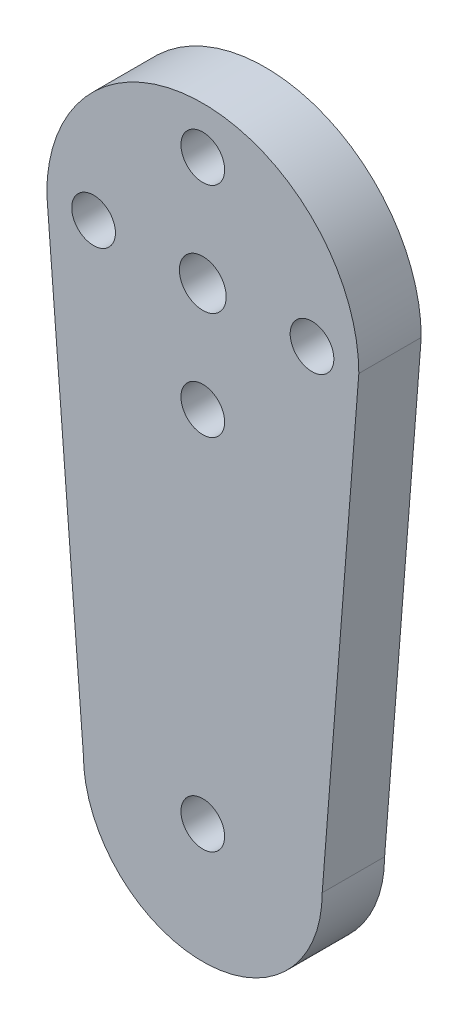
ISO-10303-21;
HEADER;
FILE_DESCRIPTION(('STEP AP214'),'2;1');
FILE_NAME('part.step','',(''),(''),'','','');
FILE_SCHEMA(('AUTOMOTIVE_DESIGN { 1 0 10303 214 1 1 1 1 }'));
ENDSEC;
DATA;
#1=APPLICATION_CONTEXT('core data for automotive mechanical design processes');
#2=APPLICATION_PROTOCOL_DEFINITION('international standard','automotive_design',2000,#1);
#3=PRODUCT_CONTEXT('',#1,'mechanical');
#4=PRODUCT('Part','Part','',(#3));
#5=PRODUCT_RELATED_PRODUCT_CATEGORY('part','',(#4));
#6=PRODUCT_DEFINITION_FORMATION('','',#4);
#7=PRODUCT_DEFINITION_CONTEXT('part definition',#1,'design');
#8=PRODUCT_DEFINITION('design','',#6,#7);
#9=PRODUCT_DEFINITION_SHAPE('','',#8);
#10=(LENGTH_UNIT() NAMED_UNIT(*) SI_UNIT(.MILLI.,.METRE.));
#11=(NAMED_UNIT(*) PLANE_ANGLE_UNIT() SI_UNIT($,.RADIAN.));
#12=(NAMED_UNIT(*) SI_UNIT($,.STERADIAN.) SOLID_ANGLE_UNIT());
#13=UNCERTAINTY_MEASURE_WITH_UNIT(LENGTH_MEASURE(1.E-05),#10,'distance_accuracy_value','');
#14=(GEOMETRIC_REPRESENTATION_CONTEXT(3) GLOBAL_UNCERTAINTY_ASSIGNED_CONTEXT((#13)) GLOBAL_UNIT_ASSIGNED_CONTEXT((#10,
#11,#12)) REPRESENTATION_CONTEXT('',''));
#15=CARTESIAN_POINT('',(0.,0.,0.));
#16=DIRECTION('',(0.,0.,1.));
#17=DIRECTION('',(1.,0.,0.));
#18=AXIS2_PLACEMENT_3D('',#15,#16,#17);
#19=CARTESIAN_POINT('',(0.,-30.,4.));
#20=DIRECTION('',(0.,0.,1.));
#21=DIRECTION('',(1.,0.,0.));
#22=AXIS2_PLACEMENT_3D('',#19,#20,#21);
#23=PLANE('',#22);
#24=CARTESIAN_POINT('',(0.,-7.,4.));
#25=DIRECTION('',(0.,0.,1.));
#26=DIRECTION('',(1.,0.,0.));
#27=AXIS2_PLACEMENT_3D('',#24,#25,#26);
#28=CIRCLE('',#27,1.4);
#29=CARTESIAN_POINT('',(1.4,-7.,4.));
#30=VERTEX_POINT('',#29);
#31=EDGE_CURVE('E234',#30,#30,#28,.T.);
#32=ORIENTED_EDGE('',*,*,#31,.F.);
#33=EDGE_LOOP('',(#32));
#34=FACE_BOUND('',#33,.T.);
#35=CARTESIAN_POINT('',(0.,0.,4.));
#36=DIRECTION('',(0.,0.,1.));
#37=DIRECTION('',(1.,0.,0.));
#38=AXIS2_PLACEMENT_3D('',#35,#36,#37);
#39=CIRCLE('',#38,1.5);
#40=CARTESIAN_POINT('',(1.5,0.,4.));
#41=VERTEX_POINT('',#40);
#42=EDGE_CURVE('E242',#41,#41,#39,.T.);
#43=ORIENTED_EDGE('',*,*,#42,.F.);
#44=EDGE_LOOP('',(#43));
#45=FACE_BOUND('',#44,.T.);
#46=CARTESIAN_POINT('',(-7.,0.,4.));
#47=DIRECTION('',(0.,0.,1.));
#48=DIRECTION('',(1.,0.,0.));
#49=AXIS2_PLACEMENT_3D('',#46,#47,#48);
#50=CIRCLE('',#49,1.4);
#51=CARTESIAN_POINT('',(-5.6,0.,4.));
#52=VERTEX_POINT('',#51);
#53=EDGE_CURVE('E192',#52,#52,#50,.T.);
#54=ORIENTED_EDGE('',*,*,#53,.F.);
#55=EDGE_LOOP('',(#54));
#56=FACE_BOUND('',#55,.T.);
#57=DIRECTION('',(0.0779982555262888,-0.99695349547251,0.));
#58=VECTOR('',#57,1.);
#59=CARTESIAN_POINT('',(-10.,0.,4.));
#60=LINE('',#59,#58);
#61=CARTESIAN_POINT('',(-10.,0.,4.));
#62=VERTEX_POINT('',#61);
#63=CARTESIAN_POINT('',(-7.65290188919029,-30.,4.));
#64=VERTEX_POINT('',#63);
#65=EDGE_CURVE('E174',#62,#64,#60,.T.);
#66=ORIENTED_EDGE('',*,*,#65,.T.);
#67=CARTESIAN_POINT('',(0.,-30.,4.));
#68=DIRECTION('',(0.,0.,1.));
#69=DIRECTION('',(1.,0.,0.));
#70=AXIS2_PLACEMENT_3D('',#67,#68,#69);
#71=CIRCLE('',#70,7.65290188919029);
#72=CARTESIAN_POINT('',(7.65290188919029,-30.,4.));
#73=VERTEX_POINT('',#72);
#74=EDGE_CURVE('E169',#64,#73,#71,.T.);
#75=ORIENTED_EDGE('',*,*,#74,.T.);
#76=DIRECTION('',(-0.0779982555262888,-0.99695349547251,0.));
#77=VECTOR('',#76,1.);
#78=CARTESIAN_POINT('',(10.,0.,4.));
#79=LINE('',#78,#77);
#80=CARTESIAN_POINT('',(10.,0.,4.));
#81=VERTEX_POINT('',#80);
#82=EDGE_CURVE('E172',#81,#73,#79,.T.);
#83=ORIENTED_EDGE('',*,*,#82,.F.);
#84=CARTESIAN_POINT('',(0.,0.,4.));
#85=DIRECTION('',(0.,0.,1.));
#86=DIRECTION('',(1.,0.,0.));
#87=AXIS2_PLACEMENT_3D('',#84,#85,#86);
#88=CIRCLE('',#87,10.);
#89=EDGE_CURVE('E143',#81,#62,#88,.T.);
#90=ORIENTED_EDGE('',*,*,#89,.T.);
#91=EDGE_LOOP('',(#66,#75,#83,#90));
#92=FACE_BOUND('',#91,.T.);
#93=CARTESIAN_POINT('',(0.,7.,4.));
#94=DIRECTION('',(0.,0.,1.));
#95=DIRECTION('',(1.,0.,0.));
#96=AXIS2_PLACEMENT_3D('',#93,#94,#95);
#97=CIRCLE('',#96,1.4);
#98=CARTESIAN_POINT('',(1.4,7.,4.));
#99=VERTEX_POINT('',#98);
#100=EDGE_CURVE('E246',#99,#99,#97,.T.);
#101=ORIENTED_EDGE('',*,*,#100,.F.);
#102=EDGE_LOOP('',(#101));
#103=FACE_BOUND('',#102,.T.);
#104=CARTESIAN_POINT('',(7.,0.,4.));
#105=DIRECTION('',(0.,0.,1.));
#106=DIRECTION('',(1.,0.,0.));
#107=AXIS2_PLACEMENT_3D('',#104,#105,#106);
#108=CIRCLE('',#107,1.4);
#109=CARTESIAN_POINT('',(8.4,0.,4.));
#110=VERTEX_POINT('',#109);
#111=EDGE_CURVE('E238',#110,#110,#108,.T.);
#112=ORIENTED_EDGE('',*,*,#111,.F.);
#113=EDGE_LOOP('',(#112));
#114=FACE_BOUND('',#113,.T.);
#115=CARTESIAN_POINT('',(0.,-30.,4.));
#116=DIRECTION('',(0.,0.,1.));
#117=DIRECTION('',(1.,0.,0.));
#118=AXIS2_PLACEMENT_3D('',#115,#116,#117);
#119=CIRCLE('',#118,1.4);
#120=CARTESIAN_POINT('',(1.4,-30.,4.));
#121=VERTEX_POINT('',#120);
#122=EDGE_CURVE('E229',#121,#121,#119,.T.);
#123=ORIENTED_EDGE('',*,*,#122,.F.);
#124=EDGE_LOOP('',(#123));
#125=FACE_BOUND('',#124,.T.);
#126=ADVANCED_FACE('F126',(#34,#45,#56,#92,#103,#114,#125),#23,.T.);
#127=CARTESIAN_POINT('',(0.,-30.,0.));
#128=DIRECTION('',(0.,0.,1.));
#129=DIRECTION('',(1.,0.,0.));
#130=AXIS2_PLACEMENT_3D('',#127,#128,#129);
#131=PLANE('',#130);
#132=DIRECTION('',(0.0779982555262888,-0.99695349547251,0.));
#133=VECTOR('',#132,1.);
#134=CARTESIAN_POINT('',(-10.,0.,0.));
#135=LINE('',#134,#133);
#136=CARTESIAN_POINT('',(-10.,0.,0.));
#137=VERTEX_POINT('',#136);
#138=CARTESIAN_POINT('',(-7.65290188919029,-30.,0.));
#139=VERTEX_POINT('',#138);
#140=EDGE_CURVE('E189',#137,#139,#135,.T.);
#141=ORIENTED_EDGE('',*,*,#140,.F.);
#142=CARTESIAN_POINT('',(0.,0.,0.));
#143=DIRECTION('',(0.,0.,1.));
#144=DIRECTION('',(1.,0.,0.));
#145=AXIS2_PLACEMENT_3D('',#142,#143,#144);
#146=CIRCLE('',#145,10.);
#147=CARTESIAN_POINT('',(10.,0.,0.));
#148=VERTEX_POINT('',#147);
#149=EDGE_CURVE('E162',#148,#137,#146,.T.);
#150=ORIENTED_EDGE('',*,*,#149,.F.);
#151=DIRECTION('',(-0.0779982555262888,-0.99695349547251,0.));
#152=VECTOR('',#151,1.);
#153=CARTESIAN_POINT('',(10.,0.,0.));
#154=LINE('',#153,#152);
#155=CARTESIAN_POINT('',(7.65290188919029,-30.,0.));
#156=VERTEX_POINT('',#155);
#157=EDGE_CURVE('E194',#148,#156,#154,.T.);
#158=ORIENTED_EDGE('',*,*,#157,.T.);
#159=CARTESIAN_POINT('',(0.,-30.,0.));
#160=DIRECTION('',(0.,0.,1.));
#161=DIRECTION('',(1.,0.,0.));
#162=AXIS2_PLACEMENT_3D('',#159,#160,#161);
#163=CIRCLE('',#162,7.65290188919029);
#164=EDGE_CURVE('E179',#139,#156,#163,.T.);
#165=ORIENTED_EDGE('',*,*,#164,.F.);
#166=EDGE_LOOP('',(#141,#150,#158,#165));
#167=FACE_BOUND('',#166,.T.);
#168=CARTESIAN_POINT('',(-7.,0.,0.));
#169=DIRECTION('',(0.,0.,1.));
#170=DIRECTION('',(1.,0.,0.));
#171=AXIS2_PLACEMENT_3D('',#168,#169,#170);
#172=CIRCLE('',#171,1.4);
#173=CARTESIAN_POINT('',(-5.6,0.,0.));
#174=VERTEX_POINT('',#173);
#175=EDGE_CURVE('E208',#174,#174,#172,.T.);
#176=ORIENTED_EDGE('',*,*,#175,.T.);
#177=EDGE_LOOP('',(#176));
#178=FACE_BOUND('',#177,.T.);
#179=CARTESIAN_POINT('',(0.,7.,0.));
#180=DIRECTION('',(0.,0.,1.));
#181=DIRECTION('',(1.,0.,0.));
#182=AXIS2_PLACEMENT_3D('',#179,#180,#181);
#183=CIRCLE('',#182,1.4);
#184=CARTESIAN_POINT('',(1.4,7.,0.));
#185=VERTEX_POINT('',#184);
#186=EDGE_CURVE('E212',#185,#185,#183,.T.);
#187=ORIENTED_EDGE('',*,*,#186,.T.);
#188=EDGE_LOOP('',(#187));
#189=FACE_BOUND('',#188,.T.);
#190=CARTESIAN_POINT('',(0.,0.,0.));
#191=DIRECTION('',(0.,0.,1.));
#192=DIRECTION('',(1.,0.,0.));
#193=AXIS2_PLACEMENT_3D('',#190,#191,#192);
#194=CIRCLE('',#193,1.5);
#195=CARTESIAN_POINT('',(1.5,0.,0.));
#196=VERTEX_POINT('',#195);
#197=EDGE_CURVE('E216',#196,#196,#194,.T.);
#198=ORIENTED_EDGE('',*,*,#197,.T.);
#199=EDGE_LOOP('',(#198));
#200=FACE_BOUND('',#199,.T.);
#201=CARTESIAN_POINT('',(7.,0.,0.));
#202=DIRECTION('',(0.,0.,1.));
#203=DIRECTION('',(1.,0.,0.));
#204=AXIS2_PLACEMENT_3D('',#201,#202,#203);
#205=CIRCLE('',#204,1.4);
#206=CARTESIAN_POINT('',(8.4,0.,0.));
#207=VERTEX_POINT('',#206);
#208=EDGE_CURVE('E220',#207,#207,#205,.T.);
#209=ORIENTED_EDGE('',*,*,#208,.T.);
#210=EDGE_LOOP('',(#209));
#211=FACE_BOUND('',#210,.T.);
#212=CARTESIAN_POINT('',(0.,-7.,0.));
#213=DIRECTION('',(0.,0.,1.));
#214=DIRECTION('',(1.,0.,0.));
#215=AXIS2_PLACEMENT_3D('',#212,#213,#214);
#216=CIRCLE('',#215,1.4);
#217=CARTESIAN_POINT('',(1.4,-7.,0.));
#218=VERTEX_POINT('',#217);
#219=EDGE_CURVE('E224',#218,#218,#216,.T.);
#220=ORIENTED_EDGE('',*,*,#219,.T.);
#221=EDGE_LOOP('',(#220));
#222=FACE_BOUND('',#221,.T.);
#223=CARTESIAN_POINT('',(0.,-30.,0.));
#224=DIRECTION('',(0.,0.,1.));
#225=DIRECTION('',(1.,0.,0.));
#226=AXIS2_PLACEMENT_3D('',#223,#224,#225);
#227=CIRCLE('',#226,1.4);
#228=CARTESIAN_POINT('',(1.4,-30.,0.));
#229=VERTEX_POINT('',#228);
#230=EDGE_CURVE('E227',#229,#229,#227,.T.);
#231=ORIENTED_EDGE('',*,*,#230,.T.);
#232=EDGE_LOOP('',(#231));
#233=FACE_BOUND('',#232,.T.);
#234=ADVANCED_FACE('F201',(#167,#178,#189,#200,#211,#222,#233),#131,.F.);
#235=CARTESIAN_POINT('',(-10.,0.,4.));
#236=DIRECTION('',(0.99695349547251,0.0779982555262888,0.));
#237=DIRECTION('',(-0.0779982555262888,0.99695349547251,0.));
#238=AXIS2_PLACEMENT_3D('',#235,#236,#237);
#239=PLANE('',#238);
#240=ORIENTED_EDGE('',*,*,#140,.T.);
#241=DIRECTION('',(0.,0.,-1.));
#242=VECTOR('',#241,1.);
#243=CARTESIAN_POINT('',(-7.65290188919029,-30.,4.));
#244=LINE('',#243,#242);
#245=EDGE_CURVE('E12',#64,#139,#244,.T.);
#246=ORIENTED_EDGE('',*,*,#245,.F.);
#247=ORIENTED_EDGE('',*,*,#65,.F.);
#248=DIRECTION('',(0.,0.,-1.));
#249=VECTOR('',#248,1.);
#250=CARTESIAN_POINT('',(-10.,0.,4.));
#251=LINE('',#250,#249);
#252=EDGE_CURVE('E185',#62,#137,#251,.T.);
#253=ORIENTED_EDGE('',*,*,#252,.T.);
#254=EDGE_LOOP('',(#240,#246,#247,#253));
#255=FACE_BOUND('',#254,.T.);
#256=ADVANCED_FACE('F128',(#255),#239,.F.);
#257=CARTESIAN_POINT('',(0.,-30.,4.));
#258=DIRECTION('',(0.,0.,-1.));
#259=DIRECTION('',(-1.,0.,0.));
#260=AXIS2_PLACEMENT_3D('',#257,#258,#259);
#261=CYLINDRICAL_SURFACE('',#260,7.65290188919029);
#262=ORIENTED_EDGE('',*,*,#164,.T.);
#263=DIRECTION('',(0.,0.,-1.));
#264=VECTOR('',#263,1.);
#265=CARTESIAN_POINT('',(7.65290188919029,-30.,4.));
#266=LINE('',#265,#264);
#267=EDGE_CURVE('E135',#73,#156,#266,.T.);
#268=ORIENTED_EDGE('',*,*,#267,.F.);
#269=ORIENTED_EDGE('',*,*,#74,.F.);
#270=ORIENTED_EDGE('',*,*,#245,.T.);
#271=EDGE_LOOP('',(#262,#268,#269,#270));
#272=FACE_BOUND('',#271,.T.);
#273=ADVANCED_FACE('F178',(#272),#261,.T.);
#274=CARTESIAN_POINT('',(10.,0.,4.));
#275=DIRECTION('',(0.99695349547251,-0.0779982555262888,0.));
#276=DIRECTION('',(0.0779982555262888,0.99695349547251,0.));
#277=AXIS2_PLACEMENT_3D('',#274,#275,#276);
#278=PLANE('',#277);
#279=ORIENTED_EDGE('',*,*,#157,.F.);
#280=DIRECTION('',(0.,0.,-1.));
#281=VECTOR('',#280,1.);
#282=CARTESIAN_POINT('',(10.,0.,4.));
#283=LINE('',#282,#281);
#284=EDGE_CURVE('E159',#81,#148,#283,.T.);
#285=ORIENTED_EDGE('',*,*,#284,.F.);
#286=ORIENTED_EDGE('',*,*,#82,.T.);
#287=ORIENTED_EDGE('',*,*,#267,.T.);
#288=EDGE_LOOP('',(#279,#285,#286,#287));
#289=FACE_BOUND('',#288,.T.);
#290=ADVANCED_FACE('F183',(#289),#278,.T.);
#291=CARTESIAN_POINT('',(0.,0.,4.));
#292=DIRECTION('',(0.,0.,-1.));
#293=DIRECTION('',(-1.,0.,0.));
#294=AXIS2_PLACEMENT_3D('',#291,#292,#293);
#295=CYLINDRICAL_SURFACE('',#294,10.);
#296=ORIENTED_EDGE('',*,*,#149,.T.);
#297=ORIENTED_EDGE('',*,*,#252,.F.);
#298=ORIENTED_EDGE('',*,*,#89,.F.);
#299=ORIENTED_EDGE('',*,*,#284,.T.);
#300=EDGE_LOOP('',(#296,#297,#298,#299));
#301=FACE_BOUND('',#300,.T.);
#302=ADVANCED_FACE('F267',(#301),#295,.T.);
#303=CARTESIAN_POINT('',(-7.,0.,4.));
#304=DIRECTION('',(0.,0.,-1.));
#305=DIRECTION('',(-1.,0.,0.));
#306=AXIS2_PLACEMENT_3D('',#303,#304,#305);
#307=CYLINDRICAL_SURFACE('',#306,1.4);
#308=ORIENTED_EDGE('',*,*,#53,.T.);
#309=EDGE_LOOP('',(#308));
#310=FACE_BOUND('',#309,.T.);
#311=ORIENTED_EDGE('',*,*,#175,.F.);
#312=EDGE_LOOP('',(#311));
#313=FACE_BOUND('',#312,.T.);
#314=ADVANCED_FACE('F254',(#310,#313),#307,.F.);
#315=CARTESIAN_POINT('',(0.,7.,4.));
#316=DIRECTION('',(0.,0.,-1.));
#317=DIRECTION('',(-1.,0.,0.));
#318=AXIS2_PLACEMENT_3D('',#315,#316,#317);
#319=CYLINDRICAL_SURFACE('',#318,1.4);
#320=ORIENTED_EDGE('',*,*,#100,.T.);
#321=EDGE_LOOP('',(#320));
#322=FACE_BOUND('',#321,.T.);
#323=ORIENTED_EDGE('',*,*,#186,.F.);
#324=EDGE_LOOP('',(#323));
#325=FACE_BOUND('',#324,.T.);
#326=ADVANCED_FACE('F341',(#322,#325),#319,.F.);
#327=CARTESIAN_POINT('',(0.,0.,4.));
#328=DIRECTION('',(0.,0.,-1.));
#329=DIRECTION('',(-1.,0.,0.));
#330=AXIS2_PLACEMENT_3D('',#327,#328,#329);
#331=CYLINDRICAL_SURFACE('',#330,1.5);
#332=ORIENTED_EDGE('',*,*,#42,.T.);
#333=EDGE_LOOP('',(#332));
#334=FACE_BOUND('',#333,.T.);
#335=ORIENTED_EDGE('',*,*,#197,.F.);
#336=EDGE_LOOP('',(#335));
#337=FACE_BOUND('',#336,.T.);
#338=ADVANCED_FACE('F348',(#334,#337),#331,.F.);
#339=CARTESIAN_POINT('',(7.,0.,4.));
#340=DIRECTION('',(0.,0.,-1.));
#341=DIRECTION('',(-1.,0.,0.));
#342=AXIS2_PLACEMENT_3D('',#339,#340,#341);
#343=CYLINDRICAL_SURFACE('',#342,1.4);
#344=ORIENTED_EDGE('',*,*,#111,.T.);
#345=EDGE_LOOP('',(#344));
#346=FACE_BOUND('',#345,.T.);
#347=ORIENTED_EDGE('',*,*,#208,.F.);
#348=EDGE_LOOP('',(#347));
#349=FACE_BOUND('',#348,.T.);
#350=ADVANCED_FACE('F356',(#346,#349),#343,.F.);
#351=CARTESIAN_POINT('',(0.,-7.,4.));
#352=DIRECTION('',(0.,0.,-1.));
#353=DIRECTION('',(-1.,0.,0.));
#354=AXIS2_PLACEMENT_3D('',#351,#352,#353);
#355=CYLINDRICAL_SURFACE('',#354,1.4);
#356=ORIENTED_EDGE('',*,*,#31,.T.);
#357=EDGE_LOOP('',(#356));
#358=FACE_BOUND('',#357,.T.);
#359=ORIENTED_EDGE('',*,*,#219,.F.);
#360=EDGE_LOOP('',(#359));
#361=FACE_BOUND('',#360,.T.);
#362=ADVANCED_FACE('F365',(#358,#361),#355,.F.);
#363=CARTESIAN_POINT('',(0.,-30.,4.));
#364=DIRECTION('',(0.,0.,-1.));
#365=DIRECTION('',(-1.,0.,0.));
#366=AXIS2_PLACEMENT_3D('',#363,#364,#365);
#367=CYLINDRICAL_SURFACE('',#366,1.4);
#368=ORIENTED_EDGE('',*,*,#122,.T.);
#369=EDGE_LOOP('',(#368));
#370=FACE_BOUND('',#369,.T.);
#371=ORIENTED_EDGE('',*,*,#230,.F.);
#372=EDGE_LOOP('',(#371));
#373=FACE_BOUND('',#372,.T.);
#374=ADVANCED_FACE('F374',(#370,#373),#367,.F.);
#375=CLOSED_SHELL('',(#126,#234,#256,#273,#290,#302,#314,#326,#338,#350,#362,#374));
#376=MANIFOLD_SOLID_BREP('B2',#375);
#377=ADVANCED_BREP_SHAPE_REPRESENTATION('',(#18,#376),#14);
#378=SHAPE_DEFINITION_REPRESENTATION(#9,#377);
ENDSEC;
END-ISO-10303-21;
